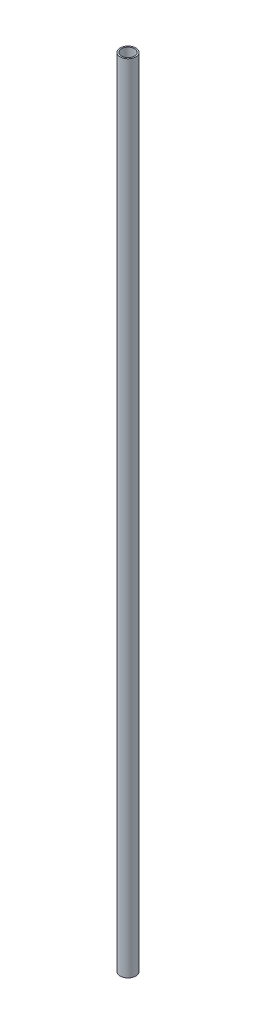
ISO-10303-21;
HEADER;
FILE_DESCRIPTION(('STEP AP214'),'2;1');
FILE_NAME('part.step','',(''),(''),'','','');
FILE_SCHEMA(('AUTOMOTIVE_DESIGN { 1 0 10303 214 1 1 1 1 }'));
ENDSEC;
DATA;
#1=APPLICATION_CONTEXT('core data for automotive mechanical design processes');
#2=APPLICATION_PROTOCOL_DEFINITION('international standard','automotive_design',2000,#1);
#3=PRODUCT_CONTEXT('',#1,'mechanical');
#4=PRODUCT('Part','Part','',(#3));
#5=PRODUCT_RELATED_PRODUCT_CATEGORY('part','',(#4));
#6=PRODUCT_DEFINITION_FORMATION('','',#4);
#7=PRODUCT_DEFINITION_CONTEXT('part definition',#1,'design');
#8=PRODUCT_DEFINITION('design','',#6,#7);
#9=PRODUCT_DEFINITION_SHAPE('','',#8);
#10=(LENGTH_UNIT() NAMED_UNIT(*) SI_UNIT(.MILLI.,.METRE.));
#11=(NAMED_UNIT(*) PLANE_ANGLE_UNIT() SI_UNIT($,.RADIAN.));
#12=(NAMED_UNIT(*) SI_UNIT($,.STERADIAN.) SOLID_ANGLE_UNIT());
#13=UNCERTAINTY_MEASURE_WITH_UNIT(LENGTH_MEASURE(1.E-05),#10,'distance_accuracy_value','');
#14=(GEOMETRIC_REPRESENTATION_CONTEXT(3) GLOBAL_UNCERTAINTY_ASSIGNED_CONTEXT((#13)) GLOBAL_UNIT_ASSIGNED_CONTEXT((#10,
#11,#12)) REPRESENTATION_CONTEXT('',''));
#15=CARTESIAN_POINT('',(0.,0.,0.));
#16=DIRECTION('',(0.,0.,1.));
#17=DIRECTION('',(1.,0.,0.));
#18=AXIS2_PLACEMENT_3D('',#15,#16,#17);
#19=CARTESIAN_POINT('',(0.,609.6,0.));
#20=DIRECTION('',(0.,1.,0.));
#21=DIRECTION('',(0.,0.,1.));
#22=AXIS2_PLACEMENT_3D('',#19,#20,#21);
#23=PLANE('',#22);
#24=CARTESIAN_POINT('',(0.,609.6,0.));
#25=DIRECTION('',(0.,1.,0.));
#26=DIRECTION('',(0.,0.,1.));
#27=AXIS2_PLACEMENT_3D('',#24,#25,#26);
#28=CIRCLE('',#27,5.9944);
#29=CARTESIAN_POINT('',(0.,609.6,5.9944));
#30=VERTEX_POINT('',#29);
#31=EDGE_CURVE('E10',#30,#30,#28,.T.);
#32=ORIENTED_EDGE('',*,*,#31,.T.);
#33=EDGE_LOOP('',(#32));
#34=FACE_BOUND('',#33,.T.);
#35=CARTESIAN_POINT('',(0.,609.6,0.));
#36=DIRECTION('',(0.,1.,0.));
#37=DIRECTION('',(0.,0.,1.));
#38=AXIS2_PLACEMENT_3D('',#35,#36,#37);
#39=CIRCLE('',#38,4.953);
#40=CARTESIAN_POINT('',(0.,609.6,4.953));
#41=VERTEX_POINT('',#40);
#42=EDGE_CURVE('E43',#41,#41,#39,.T.);
#43=ORIENTED_EDGE('',*,*,#42,.F.);
#44=EDGE_LOOP('',(#43));
#45=FACE_BOUND('',#44,.T.);
#46=ADVANCED_FACE('F32',(#34,#45),#23,.T.);
#47=CARTESIAN_POINT('',(0.,0.,0.));
#48=DIRECTION('',(0.,1.,0.));
#49=DIRECTION('',(0.,0.,1.));
#50=AXIS2_PLACEMENT_3D('',#47,#48,#49);
#51=PLANE('',#50);
#52=CARTESIAN_POINT('',(0.,0.,0.));
#53=DIRECTION('',(0.,1.,0.));
#54=DIRECTION('',(0.,0.,1.));
#55=AXIS2_PLACEMENT_3D('',#52,#53,#54);
#56=CIRCLE('',#55,5.9944);
#57=CARTESIAN_POINT('',(0.,0.,5.9944));
#58=VERTEX_POINT('',#57);
#59=EDGE_CURVE('E36',#58,#58,#56,.T.);
#60=ORIENTED_EDGE('',*,*,#59,.F.);
#61=EDGE_LOOP('',(#60));
#62=FACE_BOUND('',#61,.T.);
#63=CARTESIAN_POINT('',(0.,0.,0.));
#64=DIRECTION('',(0.,1.,0.));
#65=DIRECTION('',(0.,0.,1.));
#66=AXIS2_PLACEMENT_3D('',#63,#64,#65);
#67=CIRCLE('',#66,4.953);
#68=CARTESIAN_POINT('',(0.,0.,4.953));
#69=VERTEX_POINT('',#68);
#70=EDGE_CURVE('E45',#69,#69,#67,.T.);
#71=ORIENTED_EDGE('',*,*,#70,.T.);
#72=EDGE_LOOP('',(#71));
#73=FACE_BOUND('',#72,.T.);
#74=ADVANCED_FACE('F55',(#62,#73),#51,.F.);
#75=CARTESIAN_POINT('',(0.,609.6,0.));
#76=DIRECTION('',(0.,-1.,0.));
#77=DIRECTION('',(0.,0.,-1.));
#78=AXIS2_PLACEMENT_3D('',#75,#76,#77);
#79=CYLINDRICAL_SURFACE('',#78,5.9944);
#80=ORIENTED_EDGE('',*,*,#31,.F.);
#81=EDGE_LOOP('',(#80));
#82=FACE_BOUND('',#81,.T.);
#83=ORIENTED_EDGE('',*,*,#59,.T.);
#84=EDGE_LOOP('',(#83));
#85=FACE_BOUND('',#84,.T.);
#86=ADVANCED_FACE('F34',(#82,#85),#79,.T.);
#87=CARTESIAN_POINT('',(0.,609.6,0.));
#88=DIRECTION('',(0.,-1.,0.));
#89=DIRECTION('',(0.,0.,-1.));
#90=AXIS2_PLACEMENT_3D('',#87,#88,#89);
#91=CYLINDRICAL_SURFACE('',#90,4.953);
#92=ORIENTED_EDGE('',*,*,#42,.T.);
#93=EDGE_LOOP('',(#92));
#94=FACE_BOUND('',#93,.T.);
#95=ORIENTED_EDGE('',*,*,#70,.F.);
#96=EDGE_LOOP('',(#95));
#97=FACE_BOUND('',#96,.T.);
#98=ADVANCED_FACE('F51',(#94,#97),#91,.F.);
#99=CLOSED_SHELL('',(#46,#74,#86,#98));
#100=MANIFOLD_SOLID_BREP('B2',#99);
#101=ADVANCED_BREP_SHAPE_REPRESENTATION('',(#18,#100),#14);
#102=SHAPE_DEFINITION_REPRESENTATION(#9,#101);
ENDSEC;
END-ISO-10303-21;
